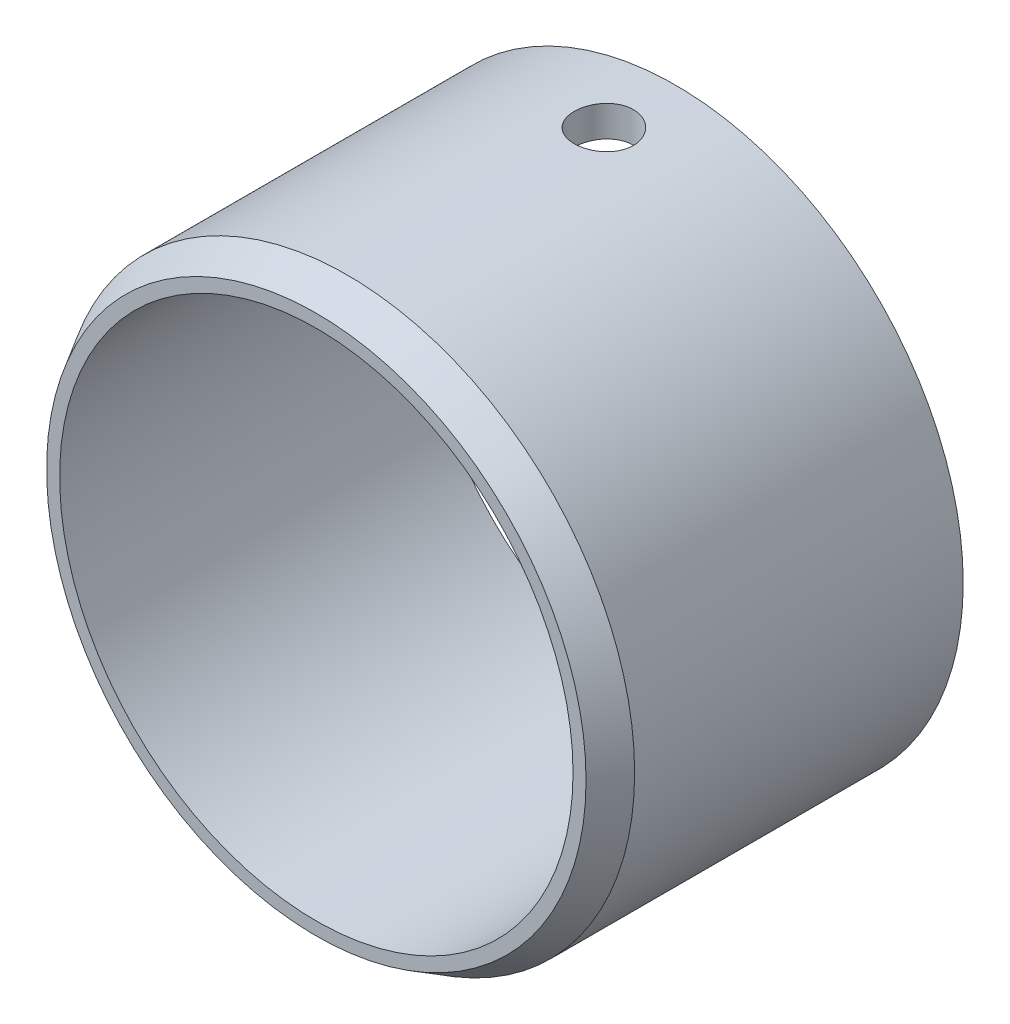
ISO-10303-21;
HEADER;
FILE_DESCRIPTION(('STEP AP214'),'2;1');
FILE_NAME('part.step','',(''),(''),'','','');
FILE_SCHEMA(('AUTOMOTIVE_DESIGN { 1 0 10303 214 1 1 1 1 }'));
ENDSEC;
DATA;
#1=APPLICATION_CONTEXT('core data for automotive mechanical design processes');
#2=APPLICATION_PROTOCOL_DEFINITION('international standard','automotive_design',2000,#1);
#3=PRODUCT_CONTEXT('',#1,'mechanical');
#4=PRODUCT('Part','Part','',(#3));
#5=PRODUCT_RELATED_PRODUCT_CATEGORY('part','',(#4));
#6=PRODUCT_DEFINITION_FORMATION('','',#4);
#7=PRODUCT_DEFINITION_CONTEXT('part definition',#1,'design');
#8=PRODUCT_DEFINITION('design','',#6,#7);
#9=PRODUCT_DEFINITION_SHAPE('','',#8);
#10=(LENGTH_UNIT() NAMED_UNIT(*) SI_UNIT(.MILLI.,.METRE.));
#11=(NAMED_UNIT(*) PLANE_ANGLE_UNIT() SI_UNIT($,.RADIAN.));
#12=(NAMED_UNIT(*) SI_UNIT($,.STERADIAN.) SOLID_ANGLE_UNIT());
#13=UNCERTAINTY_MEASURE_WITH_UNIT(LENGTH_MEASURE(1.E-05),#10,'distance_accuracy_value','');
#14=(GEOMETRIC_REPRESENTATION_CONTEXT(3) GLOBAL_UNCERTAINTY_ASSIGNED_CONTEXT((#13)) GLOBAL_UNIT_ASSIGNED_CONTEXT((#10,
#11,#12)) REPRESENTATION_CONTEXT('',''));
#15=CARTESIAN_POINT('',(0.,0.,0.));
#16=DIRECTION('',(0.,0.,1.));
#17=DIRECTION('',(1.,0.,0.));
#18=AXIS2_PLACEMENT_3D('',#15,#16,#17);
#19=CARTESIAN_POINT('',(0.,0.,22.225));
#20=DIRECTION('',(0.,0.,1.));
#21=DIRECTION('',(1.,0.,0.));
#22=AXIS2_PLACEMENT_3D('',#19,#20,#21);
#23=PLANE('',#22);
#24=CARTESIAN_POINT('',(0.,0.,22.225));
#25=DIRECTION('',(0.,0.,1.));
#26=DIRECTION('',(1.,0.,0.));
#27=AXIS2_PLACEMENT_3D('',#24,#25,#26);
#28=CIRCLE('',#27,16.6801477371938);
#29=CARTESIAN_POINT('',(16.6801477371938,0.,22.225));
#30=VERTEX_POINT('',#29);
#31=EDGE_CURVE('E44',#30,#30,#28,.T.);
#32=ORIENTED_EDGE('',*,*,#31,.T.);
#33=EDGE_LOOP('',(#32));
#34=FACE_BOUND('',#33,.T.);
#35=CARTESIAN_POINT('',(0.,0.,22.225));
#36=DIRECTION('',(0.,0.,1.));
#37=DIRECTION('',(1.,0.,0.));
#38=AXIS2_PLACEMENT_3D('',#35,#36,#37);
#39=CIRCLE('',#38,15.875);
#40=CARTESIAN_POINT('',(15.875,0.,22.225));
#41=VERTEX_POINT('',#40);
#42=EDGE_CURVE('E53',#41,#41,#39,.T.);
#43=ORIENTED_EDGE('',*,*,#42,.F.);
#44=EDGE_LOOP('',(#43));
#45=FACE_BOUND('',#44,.T.);
#46=ADVANCED_FACE('F30',(#34,#45),#23,.T.);
#47=CARTESIAN_POINT('',(0.,0.,0.));
#48=DIRECTION('',(0.,0.,1.));
#49=DIRECTION('',(1.,0.,0.));
#50=AXIS2_PLACEMENT_3D('',#47,#48,#49);
#51=PLANE('',#50);
#52=CARTESIAN_POINT('',(0.,0.,0.));
#53=DIRECTION('',(0.,0.,1.));
#54=DIRECTION('',(1.,0.,0.));
#55=AXIS2_PLACEMENT_3D('',#52,#53,#54);
#56=CIRCLE('',#55,17.78);
#57=CARTESIAN_POINT('',(17.78,0.,0.));
#58=VERTEX_POINT('',#57);
#59=EDGE_CURVE('E48',#58,#58,#56,.T.);
#60=ORIENTED_EDGE('',*,*,#59,.F.);
#61=EDGE_LOOP('',(#60));
#62=FACE_BOUND('',#61,.T.);
#63=CARTESIAN_POINT('',(0.,0.,0.));
#64=DIRECTION('',(0.,0.,1.));
#65=DIRECTION('',(1.,0.,0.));
#66=AXIS2_PLACEMENT_3D('',#63,#64,#65);
#67=CIRCLE('',#66,15.875);
#68=CARTESIAN_POINT('',(15.875,0.,0.));
#69=VERTEX_POINT('',#68);
#70=EDGE_CURVE('E54',#69,#69,#67,.T.);
#71=ORIENTED_EDGE('',*,*,#70,.T.);
#72=EDGE_LOOP('',(#71));
#73=FACE_BOUND('',#72,.T.);
#74=ADVANCED_FACE('F78',(#62,#73),#51,.F.);
#75=CARTESIAN_POINT('',(0.,0.,22.225));
#76=DIRECTION('',(0.,0.,-1.));
#77=DIRECTION('',(-1.,0.,0.));
#78=AXIS2_PLACEMENT_3D('',#75,#76,#77);
#79=CYLINDRICAL_SURFACE('',#78,17.78);
#80=CARTESIAN_POINT('',(0.,17.78,6.27379999999999));
#81=CARTESIAN_POINT('',(-0.102434179582789,17.7799987909028,6.2737955720381));
#82=CARTESIAN_POINT('',(-0.204935701242501,17.7791053836106,6.265164752541));
#83=CARTESIAN_POINT('',(-0.40709591660108,17.7756273163043,6.23086562658519));
#84=CARTESIAN_POINT('',(-0.506751370213415,17.7730408030784,6.20517865063635));
#85=CARTESIAN_POINT('',(-0.700262779382349,17.7664684344436,6.13752385776185));
#86=CARTESIAN_POINT('',(-0.794122238644518,17.7624834343602,6.09556599059492));
#87=CARTESIAN_POINT('',(-0.973446334231174,17.7535594383455,5.9965800241516));
#88=CARTESIAN_POINT('',(-1.05891261157808,17.748620629464,5.93955487888584));
#89=CARTESIAN_POINT('',(-1.21936890079848,17.7383211026582,5.81182087860838));
#90=CARTESIAN_POINT('',(-1.29432256297843,17.7329590163867,5.74106646802943));
#91=CARTESIAN_POINT('',(-1.4313134695998,17.7224285605401,5.58797965247761));
#92=CARTESIAN_POINT('',(-1.4933501106525,17.7172602000236,5.50564670694118));
#93=CARTESIAN_POINT('',(-1.60287548537553,17.7076884537935,5.33151144515828));
#94=CARTESIAN_POINT('',(-1.65033119389877,17.7032868142841,5.23968825295815));
#95=CARTESIAN_POINT('',(-1.72913673324368,17.6957639716087,5.04932364457922));
#96=CARTESIAN_POINT('',(-1.76048698368491,17.6926427350827,4.95078240351156));
#97=CARTESIAN_POINT('',(-1.80608361532209,17.6880465477666,4.75015042772461));
#98=CARTESIAN_POINT('',(-1.82039041501769,17.6865657828717,4.6480735594529));
#99=CARTESIAN_POINT('',(-1.83168081244088,17.6854001756432,4.44295755654408));
#100=CARTESIAN_POINT('',(-1.82866489026144,17.6857152835378,4.33991844865413));
#101=CARTESIAN_POINT('',(-1.8054452320121,17.6881005079361,4.13621982275005));
#102=CARTESIAN_POINT('',(-1.78530752455168,17.6901638823031,4.03555268805939));
#103=CARTESIAN_POINT('',(-1.72851869940345,17.6958026197367,3.83903457425314));
#104=CARTESIAN_POINT('',(-1.69186734701852,17.6993780042925,3.74318366360877));
#105=CARTESIAN_POINT('',(-1.60301894474225,17.7076456533608,3.55881063027856));
#106=CARTESIAN_POINT('',(-1.55079266244518,17.712340014713,3.47030269238563));
#107=CARTESIAN_POINT('',(-1.43229790839462,17.7223149244063,3.30328326347997));
#108=CARTESIAN_POINT('',(-1.36602900170841,17.7275954909011,3.22477208221062));
#109=CARTESIAN_POINT('',(-1.22096163817268,17.7381778606892,3.07959116575792));
#110=CARTESIAN_POINT('',(-1.14210616869383,17.7434796481248,3.01297838418208));
#111=CARTESIAN_POINT('',(-0.974301894530333,17.7534838405257,2.89392680171625));
#112=CARTESIAN_POINT('',(-0.885353077510125,17.7581862447584,2.84148801814925));
#113=CARTESIAN_POINT('',(-0.699847118658351,17.7664635119181,2.75227502157712));
#114=CARTESIAN_POINT('',(-0.603288543506757,17.770038161792,2.71550376799271));
#115=CARTESIAN_POINT('',(-0.405322926233954,17.7756550077742,2.65871173019886));
#116=CARTESIAN_POINT('',(-0.303916037640951,17.7776972523741,2.6386904159515));
#117=CARTESIAN_POINT('',(-0.0996255031980537,17.780012944702,2.61603900242845));
#118=CARTESIAN_POINT('',(0.00324934324496542,17.7802943841562,2.61333032546707));
#119=CARTESIAN_POINT('',(0.207988488821798,17.7790781999929,2.6251745919249));
#120=CARTESIAN_POINT('',(0.309852802392538,17.7775806018285,2.6397272883812));
#121=CARTESIAN_POINT('',(0.509452008155373,17.7729797263533,2.68561600507383));
#122=CARTESIAN_POINT('',(0.607195463175341,17.7698799761409,2.71691516368573));
#123=CARTESIAN_POINT('',(0.796044718598691,17.7624224681826,2.79537040902989));
#124=CARTESIAN_POINT('',(0.887150361983333,17.7580646806896,2.8425268707217));
#125=CARTESIAN_POINT('',(1.06049266829474,17.7485584591983,2.9515525040037));
#126=CARTESIAN_POINT('',(1.1426967586697,17.7434072781534,3.01347322002365));
#127=CARTESIAN_POINT('',(1.29557259785423,17.732900908459,3.15019585636048));
#128=CARTESIAN_POINT('',(1.36624404002193,17.7275457143896,3.22499811907646));
#129=CARTESIAN_POINT('',(1.49432193005906,17.717210773466,3.38570369072769));
#130=CARTESIAN_POINT('',(1.55167675289513,17.7122325365975,3.47164825422752));
#131=CARTESIAN_POINT('',(1.65113823724494,17.7032383222041,3.65199563814658));
#132=CARTESIAN_POINT('',(1.69324511767785,17.6992223308642,3.74639833710561));
#133=CARTESIAN_POINT('',(1.76092932397971,17.6926168259264,3.94080628370158));
#134=CARTESIAN_POINT('',(1.78653719991161,17.6900246772182,4.04080080190508));
#135=CARTESIAN_POINT('',(1.82059553558891,17.686552226833,4.24369842309604));
#136=CARTESIAN_POINT('',(1.82904651853963,17.6856718729543,4.34660143729089));
#137=CARTESIAN_POINT('',(1.82854367453686,17.6857238301566,4.55188185265715));
#138=CARTESIAN_POINT('',(1.81967094322678,17.6866476953451,4.6542594642527));
#139=CARTESIAN_POINT('',(1.7849427443052,17.6901859699218,4.85606135891711));
#140=CARTESIAN_POINT('',(1.75908725908921,17.6928003810624,4.9554856389244));
#141=CARTESIAN_POINT('',(1.69115018929291,17.6994227979414,5.14855690970497));
#142=CARTESIAN_POINT('',(1.64907114670318,17.7034305853487,5.24220480288715));
#143=CARTESIAN_POINT('',(1.54988973146467,17.7123886105447,5.42112174909081));
#144=CARTESIAN_POINT('',(1.49278741446554,17.7173388448423,5.5063908331477));
#145=CARTESIAN_POINT('',(1.36487611050434,17.7276517625364,5.66654524832364));
#146=CARTESIAN_POINT('',(1.29400667164484,17.7330161997094,5.74138218653673));
#147=CARTESIAN_POINT('',(1.14069351843122,17.7435371134097,5.87813658869697));
#148=CARTESIAN_POINT('',(1.05824704065402,17.7486935399058,5.94005095924614));
#149=CARTESIAN_POINT('',(0.883879937038066,17.7582317399066,6.04933295650406));
#150=CARTESIAN_POINT('',(0.791934819374903,17.7626114275367,6.09666165828537));
#151=CARTESIAN_POINT('',(0.601415249246473,17.7700802193521,6.17514457288144));
#152=CARTESIAN_POINT('',(0.50284838500628,17.7731707724965,6.20631695466083));
#153=CARTESIAN_POINT('',(0.336440213084749,17.7769397447427,6.24386132391461));
#154=CARTESIAN_POINT('',(0.269661304874643,17.7780819646229,6.25507290680125));
#155=CARTESIAN_POINT('',(0.135264718418274,17.7796124898244,6.27004369045675));
#156=CARTESIAN_POINT('',(0.0676470438851826,17.780000798482,6.27380292420492));
#157=CARTESIAN_POINT('',(0.,17.78,6.27379999999999));
#158=B_SPLINE_CURVE_WITH_KNOTS('',3,(#80,#81,#82,#83,#84,#85,#86,#87,#88,#89,#90,#91,#92,#93,
#94,#95,#96,#97,#98,#99,#100,#101,#102,#103,#104,#105,#106,#107,#108,#109,#110,#111,#112,#113,
#114,#115,#116,#117,#118,#119,#120,#121,#122,#123,#124,#125,#126,#127,#128,#129,#130,#131,#132,
#133,#134,#135,#136,#137,#138,#139,#140,#141,#142,#143,#144,#145,#146,#147,#148,#149,#150,#151,
#152,#153,#154,#155,#156,#157),.UNSPECIFIED.,.T.,.F.,(4,2,2,2,2,2,2,2,2,2,2,2,2,2,2,2,2,2,2,2,2,
2,2,2,2,2,2,2,2,2,2,2,2,2,2,2,2,2,4),(0.,0.307055509850231,0.614447674720588,0.921652162889684,
1.22879646680932,1.53697790469501,1.84517373533426,2.15406255542883,2.46294332717341,
2.77072583656919,3.0784998159249,3.38509224840691,3.69168903841456,3.99886493736178,
4.30605035165177,4.61466890031967,4.92328782616921,5.23196502085781,5.54063244734375,
5.84789790956641,6.15515897571633,6.46174647718741,6.76834122869306,7.07602244256803,
7.38371183605358,7.69257485309253,8.00143343551914,8.30971846975507,8.61799410259256,
8.92483009733846,9.23166641015415,9.53845466580007,9.8452417850479,10.1534077768234,
10.4616474528321,10.770702746797,11.0794097271914,11.2821886195113,11.4849666144601),.UNSPECIFIED.);
#159=CARTESIAN_POINT('',(0.,17.78,6.27379999999999));
#160=VERTEX_POINT('',#159);
#161=EDGE_CURVE('E10',#160,#160,#158,.T.);
#162=ORIENTED_EDGE('',*,*,#161,.T.);
#163=EDGE_LOOP('',(#162));
#164=FACE_BOUND('',#163,.T.);
#165=CARTESIAN_POINT('',(0.,0.,20.32));
#166=DIRECTION('',(0.,0.,1.));
#167=DIRECTION('',(1.,0.,0.));
#168=AXIS2_PLACEMENT_3D('',#165,#166,#167);
#169=CIRCLE('',#168,17.78);
#170=CARTESIAN_POINT('',(17.78,0.,20.32));
#171=VERTEX_POINT('',#170);
#172=EDGE_CURVE('E40',#171,#171,#169,.F.);
#173=ORIENTED_EDGE('',*,*,#172,.T.);
#174=EDGE_LOOP('',(#173));
#175=FACE_BOUND('',#174,.T.);
#176=ORIENTED_EDGE('',*,*,#59,.T.);
#177=EDGE_LOOP('',(#176));
#178=FACE_BOUND('',#177,.T.);
#179=ADVANCED_FACE('F83',(#164,#175,#178),#79,.T.);
#180=CARTESIAN_POINT('',(0.,0.,22.225));
#181=DIRECTION('',(0.,0.,-1.));
#182=DIRECTION('',(-1.,0.,0.));
#183=AXIS2_PLACEMENT_3D('',#180,#181,#182);
#184=CYLINDRICAL_SURFACE('',#183,15.875);
#185=CARTESIAN_POINT('',(0.,15.875,6.27379999999999));
#186=CARTESIAN_POINT('',(-0.102360699911714,15.8749986661154,6.27379561404471));
#187=CARTESIAN_POINT('',(-0.204786918872032,15.8739994972038,6.26517711629559));
#188=CARTESIAN_POINT('',(-0.406793582399011,15.8701097098853,6.23092979910975));
#189=CARTESIAN_POINT('',(-0.506370868298491,15.8672170709777,6.20528280833964));
#190=CARTESIAN_POINT('',(-0.699725621216277,15.8598664895903,6.13774036378682));
#191=CARTESIAN_POINT('',(-0.793506780125588,15.8554095558416,6.0958553792137));
#192=CARTESIAN_POINT('',(-0.972689467306199,15.8454271967042,5.99704776872916));
#193=CARTESIAN_POINT('',(-1.05809252437369,15.8399019668018,5.94012789333898));
#194=CARTESIAN_POINT('',(-1.21851586552814,15.8283716590955,5.81257924815713));
#195=CARTESIAN_POINT('',(-1.29349104976113,15.8223646639541,5.74189392212361));
#196=CARTESIAN_POINT('',(-1.43054226072539,15.8105634732738,5.58894205831738));
#197=CARTESIAN_POINT('',(-1.49261765630986,15.8047692881586,5.50667495421424));
#198=CARTESIAN_POINT('',(-1.60227205590754,15.7940306535981,5.33260581325404));
#199=CARTESIAN_POINT('',(-1.64980935975051,15.7890886659037,5.24077734255925));
#200=CARTESIAN_POINT('',(-1.72877188919126,15.7806387443429,5.05037450658306));
#201=CARTESIAN_POINT('',(-1.76019763605407,15.7771307640821,4.95180035966476));
#202=CARTESIAN_POINT('',(-1.80590920566555,15.7719640241126,4.75116948257857));
#203=CARTESIAN_POINT('',(-1.8202706908206,15.7702971035396,4.64913020503737));
#204=CARTESIAN_POINT('',(-1.83168009440588,15.7689761202399,4.44407713324063));
#205=CARTESIAN_POINT('',(-1.8287286078952,15.7693219883323,4.34106337260026));
#206=CARTESIAN_POINT('',(-1.80565806196277,15.7719800389137,4.13751040870077));
#207=CARTESIAN_POINT('',(-1.78562203914029,15.7742827104954,4.03696165236682));
#208=CARTESIAN_POINT('',(-1.7290805792983,15.7805800767171,3.84066328671928));
#209=CARTESIAN_POINT('',(-1.69257485478473,15.7845748008934,3.74491376121319));
#210=CARTESIAN_POINT('',(-1.60404000081809,15.7938170273443,3.56067205262502));
#211=CARTESIAN_POINT('',(-1.55197447169834,15.7990674613343,3.47219751396392));
#212=CARTESIAN_POINT('',(-1.43382404322721,15.8102271723015,3.30521047896627));
#213=CARTESIAN_POINT('',(-1.36773859898023,15.816136474882,3.2266983700174));
#214=CARTESIAN_POINT('',(-1.22296257056094,15.8279904286014,3.08138266076299));
#215=CARTESIAN_POINT('',(-1.14420035432966,15.8339350838587,3.0146504060609));
#216=CARTESIAN_POINT('',(-0.976554062433467,15.8451574016953,2.89534314029165));
#217=CARTESIAN_POINT('',(-0.88766996901009,15.8504350631044,2.84276815406345));
#218=CARTESIAN_POINT('',(-0.702250331608335,15.8597313418975,2.75326900490253));
#219=CARTESIAN_POINT('',(-0.605712784896937,15.8637496283603,2.71634895465922));
#220=CARTESIAN_POINT('',(-0.407752075720884,15.8700712726645,2.65926251582812));
#221=CARTESIAN_POINT('',(-0.306329107523606,15.872374698637,2.63909546164319));
#222=CARTESIAN_POINT('',(-0.102093869696725,15.8749982797904,2.6161791331191));
#223=CARTESIAN_POINT('',(0.000707226198100146,15.8753296336076,2.61333150641072));
#224=CARTESIAN_POINT('',(0.205322125974586,15.874001885435,2.62487582887591));
#225=CARTESIAN_POINT('',(0.30713594761815,15.8723428193219,2.63926746731817));
#226=CARTESIAN_POINT('',(0.506598619902934,15.8672276896576,2.68480013140674));
#227=CARTESIAN_POINT('',(0.604258234194035,15.8637766204757,2.71589461395995));
#228=CARTESIAN_POINT('',(0.792976128499662,15.8554641670712,2.79390215313314));
#229=CARTESIAN_POINT('',(0.884034215483742,15.8506027416301,2.84081567207955));
#230=CARTESIAN_POINT('',(1.05740578044552,15.8399843621546,2.94937002619908));
#231=CARTESIAN_POINT('',(1.13967892125901,15.8342235531585,3.01107490025336));
#232=CARTESIAN_POINT('',(1.29273563793392,15.8224638828086,3.14736928441528));
#233=CARTESIAN_POINT('',(1.36351882839476,15.8164650134781,3.22195922654594));
#234=CARTESIAN_POINT('',(1.49193221681517,15.8048711306547,3.38233796571228));
#235=CARTESIAN_POINT('',(1.54949748546826,15.7992781993585,3.46817892304056));
#236=CARTESIAN_POINT('',(1.6493933332356,15.7891626855837,3.64836814833904));
#237=CARTESIAN_POINT('',(1.69172417818321,15.7846400844288,3.74271626782741));
#238=CARTESIAN_POINT('',(1.7598429377748,15.7771910476892,3.93702662696358));
#239=CARTESIAN_POINT('',(1.78566830420383,15.7742610007943,4.03697559297892));
#240=CARTESIAN_POINT('',(1.82016402721642,15.77031814077,4.23982708335161));
#241=CARTESIAN_POINT('',(1.82883505269037,15.7693052528859,4.34272949238814));
#242=CARTESIAN_POINT('',(1.82876493849942,15.769313333126,4.54792118201761));
#243=CARTESIAN_POINT('',(1.82012579472583,15.7703223874576,4.6502105130437));
#244=CARTESIAN_POINT('',(1.78589567347115,15.7742351334196,4.85187357505518));
#245=CARTESIAN_POINT('',(1.760304686221,15.7771388261419,4.95124730436031));
#246=CARTESIAN_POINT('',(1.6929276788034,15.7845101522855,5.14425010066075));
#247=CARTESIAN_POINT('',(1.65114578505307,15.7889773871942,5.23788062433354));
#248=CARTESIAN_POINT('',(1.55258314615414,15.798973178662,5.41681728050837));
#249=CARTESIAN_POINT('',(1.49580232577241,15.8045017405447,5.50212337125293));
#250=CARTESIAN_POINT('',(1.36847297498386,15.8160363162651,5.66251178588278));
#251=CARTESIAN_POINT('',(1.29784836618067,15.8220448544902,5.73753353414523));
#252=CARTESIAN_POINT('',(1.1449926152937,15.8338397158933,5.87470188902679));
#253=CARTESIAN_POINT('',(1.06275872366191,15.839625986015,5.93684543693714));
#254=CARTESIAN_POINT('',(0.888716566070946,15.8503447340137,6.04666100225609));
#255=CARTESIAN_POINT('',(0.796878021284401,15.8552743729204,6.09428528026855));
#256=CARTESIAN_POINT('',(0.60650478001241,15.8636949797864,6.17336989912984));
#257=CARTESIAN_POINT('',(0.507977611371837,15.8671875348641,6.20484808129056));
#258=CARTESIAN_POINT('',(0.340766622553251,15.8714835445991,6.24307989042591));
#259=CARTESIAN_POINT('',(0.273143645390356,15.8727959070296,6.25458372022579));
#260=CARTESIAN_POINT('',(0.137023563421364,15.8745545786565,6.26994522047843));
#261=CARTESIAN_POINT('',(0.0685264637957404,15.8750008929833,6.27380293622461));
#262=CARTESIAN_POINT('',(0.,15.875,6.27379999999999));
#263=B_SPLINE_CURVE_WITH_KNOTS('',3,(#185,#186,#187,#188,#189,#190,#191,#192,#193,#194,#195,
#196,#197,#198,#199,#200,#201,#202,#203,#204,#205,#206,#207,#208,#209,#210,#211,#212,#213,#214,
#215,#216,#217,#218,#219,#220,#221,#222,#223,#224,#225,#226,#227,#228,#229,#230,#231,#232,#233,
#234,#235,#236,#237,#238,#239,#240,#241,#242,#243,#244,#245,#246,#247,#248,#249,#250,#251,#252,
#253,#254,#255,#256,#257,#258,#259,#260,#261,#262),.UNSPECIFIED.,.T.,.F.,(4,2,2,2,2,2,2,2,2,2,2,
2,2,2,2,2,2,2,2,2,2,2,2,2,2,2,2,2,2,2,2,2,2,2,2,2,2,2,4),(0.,0.30683182519023,0.613991602108095,
0.920953670707748,1.22785962173114,1.53605418229843,1.84426381832482,2.15334938706394,
2.46242495517656,2.77012491607041,3.07781430116086,3.38401668108847,3.69022440627235,
3.99715413846735,4.30409580192665,4.61283705905202,4.92157885786075,5.23040171567899,
5.53921230336676,5.8462675889855,6.15331734013109,6.45951589086122,6.76572339131181,
7.07328134803385,7.38084961885866,7.6898978659039,7.99894071994439,8.30727982657482,
8.61560691006001,8.92212259496039,9.22863845650077,9.5350762506814,9.84151558195309,
10.1496887099645,10.4579349486758,10.7671840347365,11.076090662766,11.2815037219987,
11.4869155644189),.UNSPECIFIED.);
#264=CARTESIAN_POINT('',(0.,15.875,6.27379999999999));
#265=VERTEX_POINT('',#264);
#266=EDGE_CURVE('E57',#265,#265,#263,.T.);
#267=ORIENTED_EDGE('',*,*,#266,.F.);
#268=EDGE_LOOP('',(#267));
#269=FACE_BOUND('',#268,.T.);
#270=ORIENTED_EDGE('',*,*,#42,.T.);
#271=EDGE_LOOP('',(#270));
#272=FACE_BOUND('',#271,.T.);
#273=ORIENTED_EDGE('',*,*,#70,.F.);
#274=EDGE_LOOP('',(#273));
#275=FACE_BOUND('',#274,.T.);
#276=ADVANCED_FACE('F64',(#269,#272,#275),#184,.F.);
#277=CARTESIAN_POINT('',(0.,0.,22.225));
#278=DIRECTION('',(0.,0.,-1.));
#279=DIRECTION('',(-1.,0.,0.));
#280=AXIS2_PLACEMENT_3D('',#277,#278,#279);
#281=CONICAL_SURFACE('',#280,16.6801477371938,0.523598775598297);
#282=ORIENTED_EDGE('',*,*,#172,.F.);
#283=EDGE_LOOP('',(#282));
#284=FACE_BOUND('',#283,.T.);
#285=ORIENTED_EDGE('',*,*,#31,.F.);
#286=EDGE_LOOP('',(#285));
#287=FACE_BOUND('',#286,.T.);
#288=ADVANCED_FACE('F32',(#284,#287),#281,.T.);
#289=CARTESIAN_POINT('',(0.,17.78,4.445));
#290=DIRECTION('',(0.,1.,0.));
#291=DIRECTION('',(0.,0.,1.));
#292=AXIS2_PLACEMENT_3D('',#289,#290,#291);
#293=CYLINDRICAL_SURFACE('',#292,1.8288);
#294=ORIENTED_EDGE('',*,*,#266,.T.);
#295=EDGE_LOOP('',(#294));
#296=FACE_BOUND('',#295,.T.);
#297=ORIENTED_EDGE('',*,*,#161,.F.);
#298=EDGE_LOOP('',(#297));
#299=FACE_BOUND('',#298,.T.);
#300=ADVANCED_FACE('F67',(#296,#299),#293,.F.);
#301=CLOSED_SHELL('',(#46,#74,#179,#276,#288,#300));
#302=MANIFOLD_SOLID_BREP('B2',#301);
#303=ADVANCED_BREP_SHAPE_REPRESENTATION('',(#18,#302),#14);
#304=SHAPE_DEFINITION_REPRESENTATION(#9,#303);
ENDSEC;
END-ISO-10303-21;
